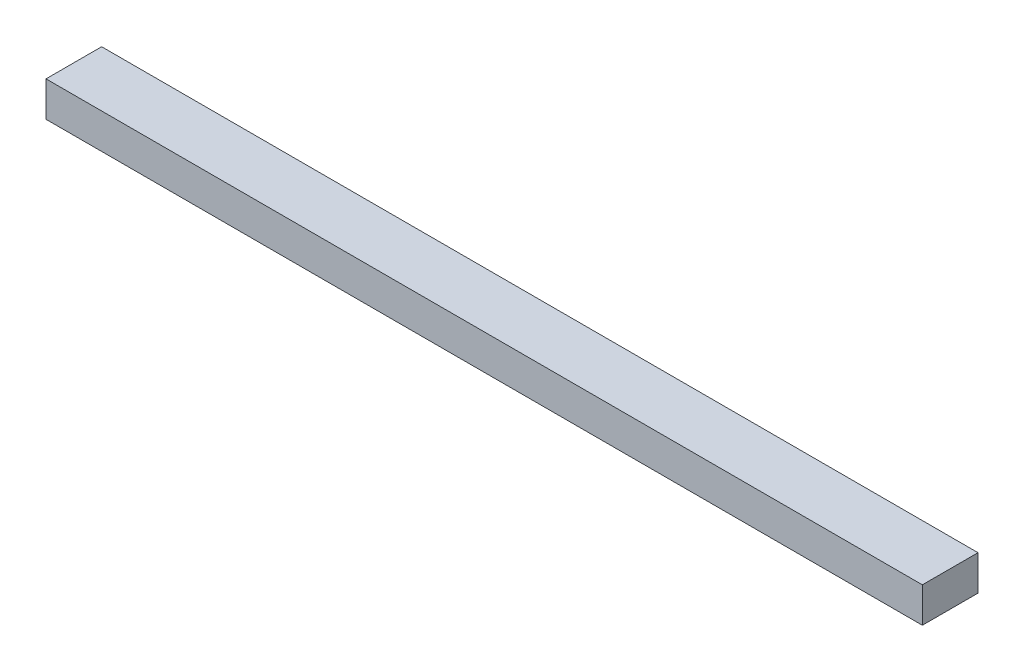
ISO-10303-21;
HEADER;
FILE_DESCRIPTION(('STEP AP214'),'2;1');
FILE_NAME('part.step','',(''),(''),'','','');
FILE_SCHEMA(('AUTOMOTIVE_DESIGN { 1 0 10303 214 1 1 1 1 }'));
ENDSEC;
DATA;
#1=APPLICATION_CONTEXT('core data for automotive mechanical design processes');
#2=APPLICATION_PROTOCOL_DEFINITION('international standard','automotive_design',2000,#1);
#3=PRODUCT_CONTEXT('',#1,'mechanical');
#4=PRODUCT('Part','Part','',(#3));
#5=PRODUCT_RELATED_PRODUCT_CATEGORY('part','',(#4));
#6=PRODUCT_DEFINITION_FORMATION('','',#4);
#7=PRODUCT_DEFINITION_CONTEXT('part definition',#1,'design');
#8=PRODUCT_DEFINITION('design','',#6,#7);
#9=PRODUCT_DEFINITION_SHAPE('','',#8);
#10=(LENGTH_UNIT() NAMED_UNIT(*) SI_UNIT(.MILLI.,.METRE.));
#11=(NAMED_UNIT(*) PLANE_ANGLE_UNIT() SI_UNIT($,.RADIAN.));
#12=(NAMED_UNIT(*) SI_UNIT($,.STERADIAN.) SOLID_ANGLE_UNIT());
#13=UNCERTAINTY_MEASURE_WITH_UNIT(LENGTH_MEASURE(1.E-05),#10,'distance_accuracy_value','');
#14=(GEOMETRIC_REPRESENTATION_CONTEXT(3) GLOBAL_UNCERTAINTY_ASSIGNED_CONTEXT((#13)) GLOBAL_UNIT_ASSIGNED_CONTEXT((#10,
#11,#12)) REPRESENTATION_CONTEXT('',''));
#15=CARTESIAN_POINT('',(0.,0.,0.));
#16=DIRECTION('',(0.,0.,1.));
#17=DIRECTION('',(1.,0.,0.));
#18=AXIS2_PLACEMENT_3D('',#15,#16,#17);
#19=CARTESIAN_POINT('',(200.,4.,-6.35));
#20=DIRECTION('',(0.,0.,1.));
#21=DIRECTION('',(0.,-1.,0.));
#22=AXIS2_PLACEMENT_3D('',#19,#20,#21);
#23=PLANE('',#22);
#24=DIRECTION('',(0.,1.,0.));
#25=VECTOR('',#24,1.);
#26=CARTESIAN_POINT('',(0.,4.,-6.35));
#27=LINE('',#26,#25);
#28=CARTESIAN_POINT('',(0.,-4.,-6.35));
#29=VERTEX_POINT('',#28);
#30=CARTESIAN_POINT('',(0.,4.,-6.35));
#31=VERTEX_POINT('',#30);
#32=EDGE_CURVE('E96',#29,#31,#27,.T.);
#33=ORIENTED_EDGE('',*,*,#32,.T.);
#34=DIRECTION('',(-1.,0.,0.));
#35=VECTOR('',#34,1.);
#36=CARTESIAN_POINT('',(200.,4.,-6.35));
#37=LINE('',#36,#35);
#38=CARTESIAN_POINT('',(200.,4.,-6.35));
#39=VERTEX_POINT('',#38);
#40=EDGE_CURVE('E11',#39,#31,#37,.T.);
#41=ORIENTED_EDGE('',*,*,#40,.F.);
#42=DIRECTION('',(0.,1.,0.));
#43=VECTOR('',#42,1.);
#44=CARTESIAN_POINT('',(200.,4.,-6.35));
#45=LINE('',#44,#43);
#46=CARTESIAN_POINT('',(200.,-4.,-6.35));
#47=VERTEX_POINT('',#46);
#48=EDGE_CURVE('E84',#47,#39,#45,.T.);
#49=ORIENTED_EDGE('',*,*,#48,.F.);
#50=DIRECTION('',(-1.,0.,0.));
#51=VECTOR('',#50,1.);
#52=CARTESIAN_POINT('',(200.,-4.,-6.35));
#53=LINE('',#52,#51);
#54=EDGE_CURVE('E92',#47,#29,#53,.T.);
#55=ORIENTED_EDGE('',*,*,#54,.T.);
#56=EDGE_LOOP('',(#33,#41,#49,#55));
#57=FACE_BOUND('',#56,.T.);
#58=ADVANCED_FACE('F33',(#57),#23,.F.);
#59=CARTESIAN_POINT('',(200.,4.,6.35));
#60=DIRECTION('',(0.,-1.,0.));
#61=DIRECTION('',(0.,0.,-1.));
#62=AXIS2_PLACEMENT_3D('',#59,#60,#61);
#63=PLANE('',#62);
#64=DIRECTION('',(0.,0.,1.));
#65=VECTOR('',#64,1.);
#66=CARTESIAN_POINT('',(0.,4.,6.35));
#67=LINE('',#66,#65);
#68=CARTESIAN_POINT('',(0.,4.,6.35));
#69=VERTEX_POINT('',#68);
#70=EDGE_CURVE('E88',#31,#69,#67,.T.);
#71=ORIENTED_EDGE('',*,*,#70,.T.);
#72=DIRECTION('',(-1.,0.,0.));
#73=VECTOR('',#72,1.);
#74=CARTESIAN_POINT('',(200.,4.,6.35));
#75=LINE('',#74,#73);
#76=CARTESIAN_POINT('',(200.,4.,6.35));
#77=VERTEX_POINT('',#76);
#78=EDGE_CURVE('E41',#77,#69,#75,.T.);
#79=ORIENTED_EDGE('',*,*,#78,.F.);
#80=DIRECTION('',(0.,0.,1.));
#81=VECTOR('',#80,1.);
#82=CARTESIAN_POINT('',(200.,4.,6.35));
#83=LINE('',#82,#81);
#84=EDGE_CURVE('E79',#39,#77,#83,.T.);
#85=ORIENTED_EDGE('',*,*,#84,.F.);
#86=ORIENTED_EDGE('',*,*,#40,.T.);
#87=EDGE_LOOP('',(#71,#79,#85,#86));
#88=FACE_BOUND('',#87,.T.);
#89=ADVANCED_FACE('F87',(#88),#63,.F.);
#90=CARTESIAN_POINT('',(200.,4.,6.35));
#91=DIRECTION('',(0.,0.,-1.));
#92=DIRECTION('',(0.,1.,0.));
#93=AXIS2_PLACEMENT_3D('',#90,#91,#92);
#94=PLANE('',#93);
#95=DIRECTION('',(0.,-1.,0.));
#96=VECTOR('',#95,1.);
#97=CARTESIAN_POINT('',(0.,4.,6.35));
#98=LINE('',#97,#96);
#99=CARTESIAN_POINT('',(0.,-4.,6.35));
#100=VERTEX_POINT('',#99);
#101=EDGE_CURVE('E66',#69,#100,#98,.T.);
#102=ORIENTED_EDGE('',*,*,#101,.T.);
#103=DIRECTION('',(-1.,0.,0.));
#104=VECTOR('',#103,1.);
#105=CARTESIAN_POINT('',(200.,-4.,6.35));
#106=LINE('',#105,#104);
#107=CARTESIAN_POINT('',(200.,-4.,6.35));
#108=VERTEX_POINT('',#107);
#109=EDGE_CURVE('E89',#108,#100,#106,.T.);
#110=ORIENTED_EDGE('',*,*,#109,.F.);
#111=DIRECTION('',(0.,-1.,0.));
#112=VECTOR('',#111,1.);
#113=CARTESIAN_POINT('',(200.,4.,6.35));
#114=LINE('',#113,#112);
#115=EDGE_CURVE('E82',#77,#108,#114,.T.);
#116=ORIENTED_EDGE('',*,*,#115,.F.);
#117=ORIENTED_EDGE('',*,*,#78,.T.);
#118=EDGE_LOOP('',(#102,#110,#116,#117));
#119=FACE_BOUND('',#118,.T.);
#120=ADVANCED_FACE('F90',(#119),#94,.F.);
#121=CARTESIAN_POINT('',(200.,-4.,6.35));
#122=DIRECTION('',(0.,1.,0.));
#123=DIRECTION('',(0.,0.,1.));
#124=AXIS2_PLACEMENT_3D('',#121,#122,#123);
#125=PLANE('',#124);
#126=DIRECTION('',(0.,0.,-1.));
#127=VECTOR('',#126,1.);
#128=CARTESIAN_POINT('',(0.,-4.,6.35));
#129=LINE('',#128,#127);
#130=EDGE_CURVE('E72',#100,#29,#129,.T.);
#131=ORIENTED_EDGE('',*,*,#130,.T.);
#132=ORIENTED_EDGE('',*,*,#54,.F.);
#133=DIRECTION('',(0.,0.,-1.));
#134=VECTOR('',#133,1.);
#135=CARTESIAN_POINT('',(200.,-4.,6.35));
#136=LINE('',#135,#134);
#137=EDGE_CURVE('E49',#108,#47,#136,.T.);
#138=ORIENTED_EDGE('',*,*,#137,.F.);
#139=ORIENTED_EDGE('',*,*,#109,.T.);
#140=EDGE_LOOP('',(#131,#132,#138,#139));
#141=FACE_BOUND('',#140,.T.);
#142=ADVANCED_FACE('F103',(#141),#125,.F.);
#143=CARTESIAN_POINT('',(200.,0.,0.));
#144=DIRECTION('',(1.,0.,0.));
#145=DIRECTION('',(0.,0.,-1.));
#146=AXIS2_PLACEMENT_3D('',#143,#144,#145);
#147=PLANE('',#146);
#148=ORIENTED_EDGE('',*,*,#48,.T.);
#149=ORIENTED_EDGE('',*,*,#84,.T.);
#150=ORIENTED_EDGE('',*,*,#115,.T.);
#151=ORIENTED_EDGE('',*,*,#137,.T.);
#152=EDGE_LOOP('',(#148,#149,#150,#151));
#153=FACE_BOUND('',#152,.T.);
#154=ADVANCED_FACE('F80',(#153),#147,.T.);
#155=CARTESIAN_POINT('',(0.,0.,0.));
#156=DIRECTION('',(1.,0.,0.));
#157=DIRECTION('',(0.,0.,-1.));
#158=AXIS2_PLACEMENT_3D('',#155,#156,#157);
#159=PLANE('',#158);
#160=ORIENTED_EDGE('',*,*,#32,.F.);
#161=ORIENTED_EDGE('',*,*,#130,.F.);
#162=ORIENTED_EDGE('',*,*,#101,.F.);
#163=ORIENTED_EDGE('',*,*,#70,.F.);
#164=EDGE_LOOP('',(#160,#161,#162,#163));
#165=FACE_BOUND('',#164,.T.);
#166=ADVANCED_FACE('F106',(#165),#159,.F.);
#167=CLOSED_SHELL('',(#58,#89,#120,#142,#154,#166));
#168=MANIFOLD_SOLID_BREP('B2',#167);
#169=ADVANCED_BREP_SHAPE_REPRESENTATION('',(#18,#168),#14);
#170=SHAPE_DEFINITION_REPRESENTATION(#9,#169);
ENDSEC;
END-ISO-10303-21;
